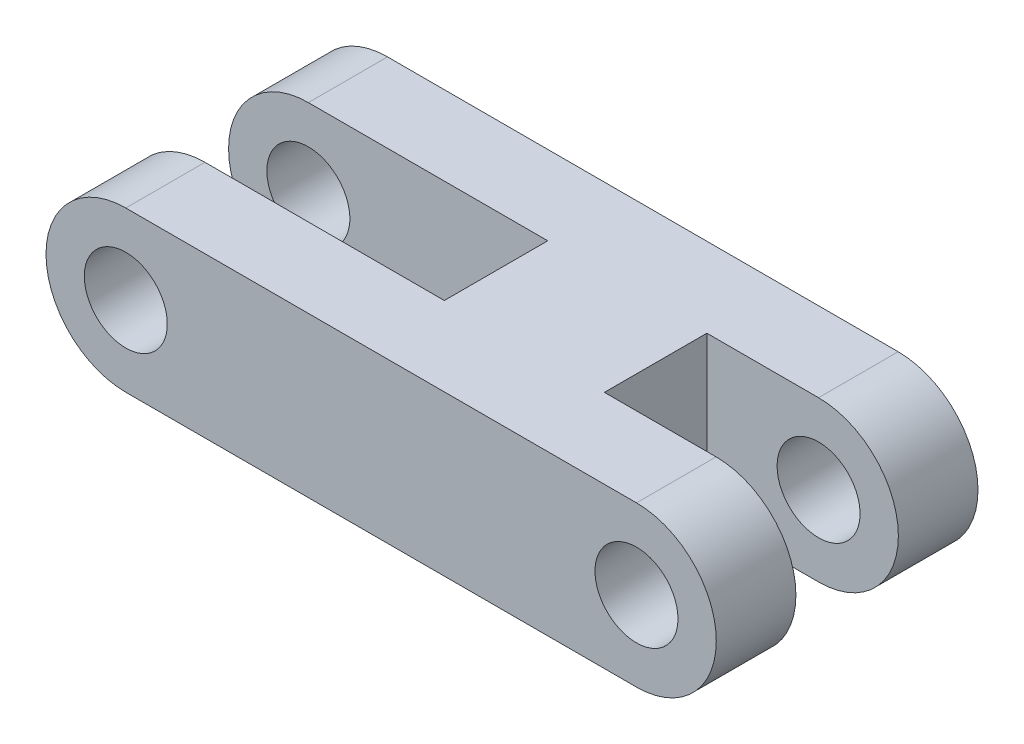
ISO-10303-21;
HEADER;
FILE_DESCRIPTION(('STEP AP214'),'2;1');
FILE_NAME('part.step','',(''),(''),'','','');
FILE_SCHEMA(('AUTOMOTIVE_DESIGN { 1 0 10303 214 1 1 1 1 }'));
ENDSEC;
DATA;
#1=APPLICATION_CONTEXT('core data for automotive mechanical design processes');
#2=APPLICATION_PROTOCOL_DEFINITION('international standard','automotive_design',2000,#1);
#3=PRODUCT_CONTEXT('',#1,'mechanical');
#4=PRODUCT('Part','Part','',(#3));
#5=PRODUCT_RELATED_PRODUCT_CATEGORY('part','',(#4));
#6=PRODUCT_DEFINITION_FORMATION('','',#4);
#7=PRODUCT_DEFINITION_CONTEXT('part definition',#1,'design');
#8=PRODUCT_DEFINITION('design','',#6,#7);
#9=PRODUCT_DEFINITION_SHAPE('','',#8);
#10=(LENGTH_UNIT() NAMED_UNIT(*) SI_UNIT(.MILLI.,.METRE.));
#11=(NAMED_UNIT(*) PLANE_ANGLE_UNIT() SI_UNIT($,.RADIAN.));
#12=(NAMED_UNIT(*) SI_UNIT($,.STERADIAN.) SOLID_ANGLE_UNIT());
#13=UNCERTAINTY_MEASURE_WITH_UNIT(LENGTH_MEASURE(1.E-05),#10,'distance_accuracy_value','');
#14=(GEOMETRIC_REPRESENTATION_CONTEXT(3) GLOBAL_UNCERTAINTY_ASSIGNED_CONTEXT((#13)) GLOBAL_UNIT_ASSIGNED_CONTEXT((#10,
#11,#12)) REPRESENTATION_CONTEXT('',''));
#15=CARTESIAN_POINT('',(0.,0.,0.));
#16=DIRECTION('',(0.,0.,1.));
#17=DIRECTION('',(1.,0.,0.));
#18=AXIS2_PLACEMENT_3D('',#15,#16,#17);
#19=CARTESIAN_POINT('',(-50.8588966961585,0.,10.414));
#20=DIRECTION('',(0.,0.,-1.));
#21=DIRECTION('',(-1.,0.,0.));
#22=AXIS2_PLACEMENT_3D('',#19,#20,#21);
#23=CYLINDRICAL_SURFACE('',#22,3.175);
#24=DIRECTION('',(0.,0.,-1.));
#25=VECTOR('',#24,1.);
#26=CARTESIAN_POINT('',(-50.8588966961585,3.17499999999999,10.414));
#27=LINE('',#26,#25);
#28=CARTESIAN_POINT('',(-50.8588966961585,3.17499999999999,3.16865));
#29=VERTEX_POINT('',#28);
#30=CARTESIAN_POINT('',(-50.8588966961585,3.17499999999999,0.));
#31=VERTEX_POINT('',#30);
#32=EDGE_CURVE('E222',#29,#31,#27,.T.);
#33=ORIENTED_EDGE('',*,*,#32,.F.);
#34=CARTESIAN_POINT('',(-50.8588966961585,0.,3.16865));
#35=DIRECTION('',(0.,0.,-1.));
#36=DIRECTION('',(-1.,0.,0.));
#37=AXIS2_PLACEMENT_3D('',#34,#35,#36);
#38=CIRCLE('',#37,3.175);
#39=CARTESIAN_POINT('',(-50.8588966961585,-3.17500000000001,3.16865));
#40=VERTEX_POINT('',#39);
#41=EDGE_CURVE('E155',#29,#40,#38,.T.);
#42=ORIENTED_EDGE('',*,*,#41,.T.);
#43=DIRECTION('',(0.,0.,-1.));
#44=VECTOR('',#43,1.);
#45=CARTESIAN_POINT('',(-50.8588966961586,-3.17500000000001,10.414));
#46=LINE('',#45,#44);
#47=CARTESIAN_POINT('',(-50.8588966961586,-3.17500000000001,0.));
#48=VERTEX_POINT('',#47);
#49=EDGE_CURVE('E226',#40,#48,#46,.T.);
#50=ORIENTED_EDGE('',*,*,#49,.T.);
#51=CARTESIAN_POINT('',(-50.8588966961585,0.,0.));
#52=DIRECTION('',(0.,0.,1.));
#53=DIRECTION('',(-1.,0.,0.));
#54=AXIS2_PLACEMENT_3D('',#51,#52,#53);
#55=CIRCLE('',#54,3.175);
#56=EDGE_CURVE('E214',#48,#31,#55,.T.);
#57=ORIENTED_EDGE('',*,*,#56,.T.);
#58=EDGE_LOOP('',(#33,#42,#50,#57));
#59=FACE_BOUND('',#58,.T.);
#60=ADVANCED_FACE('F32',(#59),#23,.T.);
#61=CARTESIAN_POINT('',(-50.8588966961585,0.,10.414));
#62=DIRECTION('',(0.,0.,-1.));
#63=DIRECTION('',(-1.,0.,0.));
#64=AXIS2_PLACEMENT_3D('',#61,#62,#63);
#65=CYLINDRICAL_SURFACE('',#64,1.651);
#66=CARTESIAN_POINT('',(-50.8588966961585,0.,3.16865));
#67=DIRECTION('',(0.,0.,-1.));
#68=DIRECTION('',(-1.,0.,0.));
#69=AXIS2_PLACEMENT_3D('',#66,#67,#68);
#70=CIRCLE('',#69,1.651);
#71=CARTESIAN_POINT('',(-52.5098966961585,0.,3.16865));
#72=VERTEX_POINT('',#71);
#73=EDGE_CURVE('E36',#72,#72,#70,.T.);
#74=ORIENTED_EDGE('',*,*,#73,.F.);
#75=EDGE_LOOP('',(#74));
#76=FACE_BOUND('',#75,.T.);
#77=CARTESIAN_POINT('',(-50.8588966961585,0.,0.));
#78=DIRECTION('',(0.,0.,1.));
#79=DIRECTION('',(1.,0.,0.));
#80=AXIS2_PLACEMENT_3D('',#77,#78,#79);
#81=CIRCLE('',#80,1.651);
#82=CARTESIAN_POINT('',(-49.2078966961585,0.,0.));
#83=VERTEX_POINT('',#82);
#84=EDGE_CURVE('E189',#83,#83,#81,.T.);
#85=ORIENTED_EDGE('',*,*,#84,.F.);
#86=EDGE_LOOP('',(#85));
#87=FACE_BOUND('',#86,.T.);
#88=ADVANCED_FACE('F242',(#76,#87),#65,.F.);
#89=CARTESIAN_POINT('',(-71.1788966961585,0.,10.414));
#90=DIRECTION('',(0.,0.,-1.));
#91=DIRECTION('',(-1.,0.,0.));
#92=AXIS2_PLACEMENT_3D('',#89,#90,#91);
#93=CYLINDRICAL_SURFACE('',#92,3.175);
#94=CARTESIAN_POINT('',(-71.1788966961585,0.,3.14960000000001));
#95=DIRECTION('',(0.,0.,-1.));
#96=DIRECTION('',(-1.,0.,0.));
#97=AXIS2_PLACEMENT_3D('',#94,#95,#96);
#98=CIRCLE('',#97,3.175);
#99=CARTESIAN_POINT('',(-71.1788966961585,-3.17500000000001,3.14960000000001));
#100=VERTEX_POINT('',#99);
#101=CARTESIAN_POINT('',(-71.1788966961585,3.17499999999999,3.14960000000001));
#102=VERTEX_POINT('',#101);
#103=EDGE_CURVE('E183',#100,#102,#98,.T.);
#104=ORIENTED_EDGE('',*,*,#103,.T.);
#105=DIRECTION('',(0.,0.,-1.));
#106=VECTOR('',#105,1.);
#107=CARTESIAN_POINT('',(-71.1788966961585,3.17499999999999,10.414));
#108=LINE('',#107,#106);
#109=CARTESIAN_POINT('',(-71.1788966961585,3.17499999999999,0.));
#110=VERTEX_POINT('',#109);
#111=EDGE_CURVE('E208',#102,#110,#108,.T.);
#112=ORIENTED_EDGE('',*,*,#111,.T.);
#113=CARTESIAN_POINT('',(-71.1788966961585,0.,0.));
#114=DIRECTION('',(0.,0.,1.));
#115=DIRECTION('',(1.,0.,0.));
#116=AXIS2_PLACEMENT_3D('',#113,#114,#115);
#117=CIRCLE('',#116,3.175);
#118=CARTESIAN_POINT('',(-71.1788966961585,-3.17500000000001,0.));
#119=VERTEX_POINT('',#118);
#120=EDGE_CURVE('E195',#110,#119,#117,.T.);
#121=ORIENTED_EDGE('',*,*,#120,.T.);
#122=DIRECTION('',(0.,0.,-1.));
#123=VECTOR('',#122,1.);
#124=CARTESIAN_POINT('',(-71.1788966961585,-3.17500000000001,10.414));
#125=LINE('',#124,#123);
#126=EDGE_CURVE('E41',#100,#119,#125,.T.);
#127=ORIENTED_EDGE('',*,*,#126,.F.);
#128=EDGE_LOOP('',(#104,#112,#121,#127));
#129=FACE_BOUND('',#128,.T.);
#130=ADVANCED_FACE('F269',(#129),#93,.T.);
#131=CARTESIAN_POINT('',(-71.1788966961585,0.,10.414));
#132=DIRECTION('',(0.,0.,-1.));
#133=DIRECTION('',(-1.,0.,0.));
#134=AXIS2_PLACEMENT_3D('',#131,#132,#133);
#135=CYLINDRICAL_SURFACE('',#134,1.65099999999999);
#136=CARTESIAN_POINT('',(-71.1788966961585,0.,3.14960000000001));
#137=DIRECTION('',(0.,0.,-1.));
#138=DIRECTION('',(-1.,0.,0.));
#139=AXIS2_PLACEMENT_3D('',#136,#137,#138);
#140=CIRCLE('',#139,1.65099999999999);
#141=CARTESIAN_POINT('',(-72.8298966961585,0.,3.14960000000001));
#142=VERTEX_POINT('',#141);
#143=EDGE_CURVE('E182',#142,#142,#140,.T.);
#144=ORIENTED_EDGE('',*,*,#143,.F.);
#145=EDGE_LOOP('',(#144));
#146=FACE_BOUND('',#145,.T.);
#147=CARTESIAN_POINT('',(-71.1788966961585,0.,0.));
#148=DIRECTION('',(0.,0.,1.));
#149=DIRECTION('',(-1.,0.,0.));
#150=AXIS2_PLACEMENT_3D('',#147,#148,#149);
#151=CIRCLE('',#150,1.65099999999999);
#152=CARTESIAN_POINT('',(-72.8298966961585,0.,0.));
#153=VERTEX_POINT('',#152);
#154=EDGE_CURVE('E185',#153,#153,#151,.T.);
#155=ORIENTED_EDGE('',*,*,#154,.F.);
#156=EDGE_LOOP('',(#155));
#157=FACE_BOUND('',#156,.T.);
#158=ADVANCED_FACE('F249',(#146,#157),#135,.F.);
#159=CARTESIAN_POINT('',(-71.1788966961585,0.,10.414));
#160=DIRECTION('',(0.,0.,1.));
#161=DIRECTION('',(1.,0.,0.));
#162=AXIS2_PLACEMENT_3D('',#159,#160,#161);
#163=PLANE('',#162);
#164=CARTESIAN_POINT('',(-50.8588966961585,0.,10.414));
#165=DIRECTION('',(0.,0.,1.));
#166=DIRECTION('',(1.,0.,0.));
#167=AXIS2_PLACEMENT_3D('',#164,#165,#166);
#168=CIRCLE('',#167,1.651);
#169=CARTESIAN_POINT('',(-49.2078966961585,0.,10.414));
#170=VERTEX_POINT('',#169);
#171=EDGE_CURVE('E192',#170,#170,#168,.T.);
#172=ORIENTED_EDGE('',*,*,#171,.F.);
#173=EDGE_LOOP('',(#172));
#174=FACE_BOUND('',#173,.T.);
#175=CARTESIAN_POINT('',(-71.1788966961585,0.,10.414));
#176=DIRECTION('',(0.,0.,1.));
#177=DIRECTION('',(1.,0.,0.));
#178=AXIS2_PLACEMENT_3D('',#175,#176,#177);
#179=CIRCLE('',#178,3.175);
#180=CARTESIAN_POINT('',(-71.1788966961585,3.17499999999999,10.414));
#181=VERTEX_POINT('',#180);
#182=CARTESIAN_POINT('',(-71.1788966961585,-3.17500000000001,10.414));
#183=VERTEX_POINT('',#182);
#184=EDGE_CURVE('E198',#181,#183,#179,.T.);
#185=ORIENTED_EDGE('',*,*,#184,.T.);
#186=DIRECTION('',(1.,0.,0.));
#187=VECTOR('',#186,1.);
#188=CARTESIAN_POINT('',(-71.1788966961585,-3.17500000000001,10.414));
#189=LINE('',#188,#187);
#190=CARTESIAN_POINT('',(-50.8588966961586,-3.17500000000001,10.414));
#191=VERTEX_POINT('',#190);
#192=EDGE_CURVE('E201',#183,#191,#189,.T.);
#193=ORIENTED_EDGE('',*,*,#192,.T.);
#194=CARTESIAN_POINT('',(-50.8588966961585,0.,10.414));
#195=DIRECTION('',(0.,0.,1.));
#196=DIRECTION('',(-1.,0.,0.));
#197=AXIS2_PLACEMENT_3D('',#194,#195,#196);
#198=CIRCLE('',#197,3.175);
#199=CARTESIAN_POINT('',(-50.8588966961585,3.17499999999999,10.414));
#200=VERTEX_POINT('',#199);
#201=EDGE_CURVE('E204',#191,#200,#198,.T.);
#202=ORIENTED_EDGE('',*,*,#201,.T.);
#203=DIRECTION('',(-1.,0.,0.));
#204=VECTOR('',#203,1.);
#205=CARTESIAN_POINT('',(-71.1788966961585,3.17499999999999,10.414));
#206=LINE('',#205,#204);
#207=EDGE_CURVE('E206',#200,#181,#206,.T.);
#208=ORIENTED_EDGE('',*,*,#207,.T.);
#209=EDGE_LOOP('',(#185,#193,#202,#208));
#210=FACE_BOUND('',#209,.T.);
#211=CARTESIAN_POINT('',(-71.1788966961585,0.,10.414));
#212=DIRECTION('',(0.,0.,1.));
#213=DIRECTION('',(-1.,0.,0.));
#214=AXIS2_PLACEMENT_3D('',#211,#212,#213);
#215=CIRCLE('',#214,1.65099999999999);
#216=CARTESIAN_POINT('',(-72.8298966961585,0.,10.414));
#217=VERTEX_POINT('',#216);
#218=EDGE_CURVE('E186',#217,#217,#215,.T.);
#219=ORIENTED_EDGE('',*,*,#218,.F.);
#220=EDGE_LOOP('',(#219));
#221=FACE_BOUND('',#220,.T.);
#222=ADVANCED_FACE('F245',(#174,#210,#221),#163,.T.);
#223=CARTESIAN_POINT('',(-71.1788966961585,0.,0.));
#224=DIRECTION('',(0.,0.,1.));
#225=DIRECTION('',(1.,0.,0.));
#226=AXIS2_PLACEMENT_3D('',#223,#224,#225);
#227=PLANE('',#226);
#228=ORIENTED_EDGE('',*,*,#84,.T.);
#229=EDGE_LOOP('',(#228));
#230=FACE_BOUND('',#229,.T.);
#231=ORIENTED_EDGE('',*,*,#120,.F.);
#232=DIRECTION('',(-1.,0.,0.));
#233=VECTOR('',#232,1.);
#234=CARTESIAN_POINT('',(-71.1788966961585,3.17499999999999,0.));
#235=LINE('',#234,#233);
#236=EDGE_CURVE('E202',#31,#110,#235,.T.);
#237=ORIENTED_EDGE('',*,*,#236,.F.);
#238=ORIENTED_EDGE('',*,*,#56,.F.);
#239=DIRECTION('',(1.,0.,0.));
#240=VECTOR('',#239,1.);
#241=CARTESIAN_POINT('',(-71.1788966961585,-3.17500000000001,0.));
#242=LINE('',#241,#240);
#243=EDGE_CURVE('E211',#119,#48,#242,.T.);
#244=ORIENTED_EDGE('',*,*,#243,.F.);
#245=EDGE_LOOP('',(#231,#237,#238,#244));
#246=FACE_BOUND('',#245,.T.);
#247=ORIENTED_EDGE('',*,*,#154,.T.);
#248=EDGE_LOOP('',(#247));
#249=FACE_BOUND('',#248,.T.);
#250=ADVANCED_FACE('F248',(#230,#246,#249),#227,.F.);
#251=CARTESIAN_POINT('',(-71.1788966961585,3.17499999999999,7.26440000000001));
#252=VERTEX_POINT('',#251);
#253=EDGE_CURVE('E219',#181,#252,#108,.T.);
#254=ORIENTED_EDGE('',*,*,#253,.T.);
#255=CARTESIAN_POINT('',(-71.1788966961585,0.,7.26440000000001));
#256=DIRECTION('',(0.,0.,1.));
#257=DIRECTION('',(1.,0.,0.));
#258=AXIS2_PLACEMENT_3D('',#255,#256,#257);
#259=CIRCLE('',#258,3.175);
#260=CARTESIAN_POINT('',(-71.1788966961585,-3.17500000000001,7.26440000000001));
#261=VERTEX_POINT('',#260);
#262=EDGE_CURVE('E57',#252,#261,#259,.T.);
#263=ORIENTED_EDGE('',*,*,#262,.T.);
#264=EDGE_CURVE('E11',#183,#261,#125,.T.);
#265=ORIENTED_EDGE('',*,*,#264,.F.);
#266=ORIENTED_EDGE('',*,*,#184,.F.);
#267=EDGE_LOOP('',(#254,#263,#265,#266));
#268=FACE_BOUND('',#267,.T.);
#269=ADVANCED_FACE('F34',(#268),#93,.T.);
#270=CARTESIAN_POINT('',(-71.1788966961585,-3.17500000000001,10.414));
#271=DIRECTION('',(0.,1.,0.));
#272=DIRECTION('',(-1.,0.,0.));
#273=AXIS2_PLACEMENT_3D('',#270,#271,#272);
#274=PLANE('',#273);
#275=ORIENTED_EDGE('',*,*,#49,.F.);
#276=DIRECTION('',(-1.,0.,0.));
#277=VECTOR('',#276,1.);
#278=CARTESIAN_POINT('',(-55.3038966961586,-3.17500000000001,3.16865));
#279=LINE('',#278,#277);
#280=CARTESIAN_POINT('',(-55.3038966961586,-3.17500000000001,3.16865));
#281=VERTEX_POINT('',#280);
#282=EDGE_CURVE('E131',#40,#281,#279,.T.);
#283=ORIENTED_EDGE('',*,*,#282,.T.);
#284=DIRECTION('',(0.,0.,1.));
#285=VECTOR('',#284,1.);
#286=CARTESIAN_POINT('',(-55.3038966961586,-3.17500000000001,7.24535));
#287=LINE('',#286,#285);
#288=CARTESIAN_POINT('',(-55.3038966961586,-3.17500000000001,7.24535));
#289=VERTEX_POINT('',#288);
#290=EDGE_CURVE('E126',#281,#289,#287,.T.);
#291=ORIENTED_EDGE('',*,*,#290,.T.);
#292=DIRECTION('',(1.,0.,0.));
#293=VECTOR('',#292,1.);
#294=CARTESIAN_POINT('',(-55.3038966961586,-3.17500000000001,7.24535));
#295=LINE('',#294,#293);
#296=CARTESIAN_POINT('',(-50.8588966961585,-3.17500000000001,7.24535));
#297=VERTEX_POINT('',#296);
#298=EDGE_CURVE('E134',#289,#297,#295,.T.);
#299=ORIENTED_EDGE('',*,*,#298,.T.);
#300=EDGE_CURVE('E227',#191,#297,#46,.T.);
#301=ORIENTED_EDGE('',*,*,#300,.F.);
#302=ORIENTED_EDGE('',*,*,#192,.F.);
#303=ORIENTED_EDGE('',*,*,#264,.T.);
#304=DIRECTION('',(1.,0.,0.));
#305=VECTOR('',#304,1.);
#306=CARTESIAN_POINT('',(-61.6538966961585,-3.17500000000001,7.26440000000001));
#307=LINE('',#306,#305);
#308=CARTESIAN_POINT('',(-61.6538966961585,-3.17500000000001,7.26440000000001));
#309=VERTEX_POINT('',#308);
#310=EDGE_CURVE('E159',#261,#309,#307,.T.);
#311=ORIENTED_EDGE('',*,*,#310,.T.);
#312=DIRECTION('',(0.,0.,-1.));
#313=VECTOR('',#312,1.);
#314=CARTESIAN_POINT('',(-61.6538966961585,-3.17500000000001,7.26440000000001));
#315=LINE('',#314,#313);
#316=CARTESIAN_POINT('',(-61.6538966961585,-3.17500000000001,3.1496));
#317=VERTEX_POINT('',#316);
#318=EDGE_CURVE('E162',#309,#317,#315,.T.);
#319=ORIENTED_EDGE('',*,*,#318,.T.);
#320=DIRECTION('',(-1.,0.,0.));
#321=VECTOR('',#320,1.);
#322=CARTESIAN_POINT('',(-61.6538966961585,-3.17500000000001,3.1496));
#323=LINE('',#322,#321);
#324=EDGE_CURVE('E166',#317,#100,#323,.T.);
#325=ORIENTED_EDGE('',*,*,#324,.T.);
#326=ORIENTED_EDGE('',*,*,#126,.T.);
#327=ORIENTED_EDGE('',*,*,#243,.T.);
#328=EDGE_LOOP('',(#275,#283,#291,#299,#301,#302,#303,#311,#319,#325,#326,#327));
#329=FACE_BOUND('',#328,.T.);
#330=ADVANCED_FACE('F143',(#329),#274,.F.);
#331=ORIENTED_EDGE('',*,*,#300,.T.);
#332=CARTESIAN_POINT('',(-50.8588966961585,0.,7.24535));
#333=DIRECTION('',(0.,0.,1.));
#334=DIRECTION('',(1.,0.,0.));
#335=AXIS2_PLACEMENT_3D('',#332,#333,#334);
#336=CIRCLE('',#335,3.175);
#337=CARTESIAN_POINT('',(-50.8588966961585,3.17499999999999,7.24535));
#338=VERTEX_POINT('',#337);
#339=EDGE_CURVE('E137',#297,#338,#336,.T.);
#340=ORIENTED_EDGE('',*,*,#339,.T.);
#341=EDGE_CURVE('E223',#200,#338,#27,.T.);
#342=ORIENTED_EDGE('',*,*,#341,.F.);
#343=ORIENTED_EDGE('',*,*,#201,.F.);
#344=EDGE_LOOP('',(#331,#340,#342,#343));
#345=FACE_BOUND('',#344,.T.);
#346=ADVANCED_FACE('F274',(#345),#23,.T.);
#347=CARTESIAN_POINT('',(-71.1788966961585,3.17499999999999,10.414));
#348=DIRECTION('',(0.,-1.,0.));
#349=DIRECTION('',(1.,0.,0.));
#350=AXIS2_PLACEMENT_3D('',#347,#348,#349);
#351=PLANE('',#350);
#352=DIRECTION('',(0.,0.,1.));
#353=VECTOR('',#352,1.);
#354=CARTESIAN_POINT('',(-55.3038966961586,3.17499999999999,7.24535));
#355=LINE('',#354,#353);
#356=CARTESIAN_POINT('',(-55.3038966961586,3.17499999999999,3.16865));
#357=VERTEX_POINT('',#356);
#358=CARTESIAN_POINT('',(-55.3038966961586,3.17499999999999,7.24535));
#359=VERTEX_POINT('',#358);
#360=EDGE_CURVE('E49',#357,#359,#355,.T.);
#361=ORIENTED_EDGE('',*,*,#360,.F.);
#362=DIRECTION('',(-1.,0.,0.));
#363=VECTOR('',#362,1.);
#364=CARTESIAN_POINT('',(-55.3038966961586,3.17499999999999,3.16865));
#365=LINE('',#364,#363);
#366=EDGE_CURVE('E144',#29,#357,#365,.T.);
#367=ORIENTED_EDGE('',*,*,#366,.F.);
#368=ORIENTED_EDGE('',*,*,#32,.T.);
#369=ORIENTED_EDGE('',*,*,#236,.T.);
#370=ORIENTED_EDGE('',*,*,#111,.F.);
#371=DIRECTION('',(-1.,0.,0.));
#372=VECTOR('',#371,1.);
#373=CARTESIAN_POINT('',(-61.6538966961585,3.17499999999999,3.1496));
#374=LINE('',#373,#372);
#375=CARTESIAN_POINT('',(-61.6538966961585,3.17499999999999,3.1496));
#376=VERTEX_POINT('',#375);
#377=EDGE_CURVE('E163',#376,#102,#374,.T.);
#378=ORIENTED_EDGE('',*,*,#377,.F.);
#379=DIRECTION('',(0.,0.,-1.));
#380=VECTOR('',#379,1.);
#381=CARTESIAN_POINT('',(-61.6538966961585,3.17499999999999,7.26440000000001));
#382=LINE('',#381,#380);
#383=CARTESIAN_POINT('',(-61.6538966961585,3.17499999999999,7.26440000000001));
#384=VERTEX_POINT('',#383);
#385=EDGE_CURVE('E171',#384,#376,#382,.T.);
#386=ORIENTED_EDGE('',*,*,#385,.F.);
#387=DIRECTION('',(1.,0.,0.));
#388=VECTOR('',#387,1.);
#389=CARTESIAN_POINT('',(-61.6538966961585,3.17499999999999,7.26440000000001));
#390=LINE('',#389,#388);
#391=EDGE_CURVE('E158',#252,#384,#390,.T.);
#392=ORIENTED_EDGE('',*,*,#391,.F.);
#393=ORIENTED_EDGE('',*,*,#253,.F.);
#394=ORIENTED_EDGE('',*,*,#207,.F.);
#395=ORIENTED_EDGE('',*,*,#341,.T.);
#396=DIRECTION('',(1.,0.,0.));
#397=VECTOR('',#396,1.);
#398=CARTESIAN_POINT('',(-55.3038966961586,3.17499999999999,7.24535));
#399=LINE('',#398,#397);
#400=EDGE_CURVE('E146',#359,#338,#399,.T.);
#401=ORIENTED_EDGE('',*,*,#400,.F.);
#402=EDGE_LOOP('',(#361,#367,#368,#369,#370,#378,#386,#392,#393,#394,#395,#401));
#403=FACE_BOUND('',#402,.T.);
#404=ADVANCED_FACE('F240',(#403),#351,.F.);
#405=CARTESIAN_POINT('',(-50.8588966961585,0.,7.24535));
#406=DIRECTION('',(0.,0.,1.));
#407=DIRECTION('',(1.,0.,0.));
#408=AXIS2_PLACEMENT_3D('',#405,#406,#407);
#409=CIRCLE('',#408,1.651);
#410=CARTESIAN_POINT('',(-49.2078966961585,0.,7.24535));
#411=VERTEX_POINT('',#410);
#412=EDGE_CURVE('E152',#411,#411,#409,.T.);
#413=ORIENTED_EDGE('',*,*,#412,.F.);
#414=EDGE_LOOP('',(#413));
#415=FACE_BOUND('',#414,.T.);
#416=ORIENTED_EDGE('',*,*,#171,.T.);
#417=EDGE_LOOP('',(#416));
#418=FACE_BOUND('',#417,.T.);
#419=ADVANCED_FACE('F236',(#415,#418),#65,.F.);
#420=CARTESIAN_POINT('',(-71.1788966961585,0.,7.26440000000001));
#421=DIRECTION('',(0.,0.,1.));
#422=DIRECTION('',(1.,0.,0.));
#423=AXIS2_PLACEMENT_3D('',#420,#421,#422);
#424=CIRCLE('',#423,1.65099999999999);
#425=CARTESIAN_POINT('',(-69.5278966961586,0.,7.26440000000001));
#426=VERTEX_POINT('',#425);
#427=EDGE_CURVE('E178',#426,#426,#424,.T.);
#428=ORIENTED_EDGE('',*,*,#427,.F.);
#429=EDGE_LOOP('',(#428));
#430=FACE_BOUND('',#429,.T.);
#431=ORIENTED_EDGE('',*,*,#218,.T.);
#432=EDGE_LOOP('',(#431));
#433=FACE_BOUND('',#432,.T.);
#434=ADVANCED_FACE('F239',(#430,#433),#135,.F.);
#435=CARTESIAN_POINT('',(-61.6538966961585,-3.17500000000001,3.1496));
#436=DIRECTION('',(0.,0.,-1.));
#437=DIRECTION('',(-1.,0.,0.));
#438=AXIS2_PLACEMENT_3D('',#435,#436,#437);
#439=PLANE('',#438);
#440=ORIENTED_EDGE('',*,*,#143,.T.);
#441=EDGE_LOOP('',(#440));
#442=FACE_BOUND('',#441,.T.);
#443=ORIENTED_EDGE('',*,*,#103,.F.);
#444=ORIENTED_EDGE('',*,*,#324,.F.);
#445=DIRECTION('',(0.,1.,0.));
#446=VECTOR('',#445,1.);
#447=CARTESIAN_POINT('',(-61.6538966961585,-3.17500000000001,3.1496));
#448=LINE('',#447,#446);
#449=EDGE_CURVE('E176',#317,#376,#448,.T.);
#450=ORIENTED_EDGE('',*,*,#449,.T.);
#451=ORIENTED_EDGE('',*,*,#377,.T.);
#452=EDGE_LOOP('',(#443,#444,#450,#451));
#453=FACE_BOUND('',#452,.T.);
#454=ADVANCED_FACE('F257',(#442,#453),#439,.F.);
#455=CARTESIAN_POINT('',(-61.6538966961585,-3.17500000000001,7.26440000000001));
#456=DIRECTION('',(0.,0.,1.));
#457=DIRECTION('',(1.,0.,0.));
#458=AXIS2_PLACEMENT_3D('',#455,#456,#457);
#459=PLANE('',#458);
#460=ORIENTED_EDGE('',*,*,#427,.T.);
#461=EDGE_LOOP('',(#460));
#462=FACE_BOUND('',#461,.T.);
#463=ORIENTED_EDGE('',*,*,#391,.T.);
#464=DIRECTION('',(0.,1.,0.));
#465=VECTOR('',#464,1.);
#466=CARTESIAN_POINT('',(-61.6538966961585,-3.17500000000001,7.26440000000001));
#467=LINE('',#466,#465);
#468=EDGE_CURVE('E169',#309,#384,#467,.T.);
#469=ORIENTED_EDGE('',*,*,#468,.F.);
#470=ORIENTED_EDGE('',*,*,#310,.F.);
#471=ORIENTED_EDGE('',*,*,#262,.F.);
#472=EDGE_LOOP('',(#463,#469,#470,#471));
#473=FACE_BOUND('',#472,.T.);
#474=ADVANCED_FACE('F263',(#462,#473),#459,.F.);
#475=CARTESIAN_POINT('',(-61.6538966961585,-3.17500000000001,7.26440000000001));
#476=DIRECTION('',(1.,0.,0.));
#477=DIRECTION('',(0.,1.,0.));
#478=AXIS2_PLACEMENT_3D('',#475,#476,#477);
#479=PLANE('',#478);
#480=ORIENTED_EDGE('',*,*,#385,.T.);
#481=ORIENTED_EDGE('',*,*,#449,.F.);
#482=ORIENTED_EDGE('',*,*,#318,.F.);
#483=ORIENTED_EDGE('',*,*,#468,.T.);
#484=EDGE_LOOP('',(#480,#481,#482,#483));
#485=FACE_BOUND('',#484,.T.);
#486=ADVANCED_FACE('F298',(#485),#479,.F.);
#487=CARTESIAN_POINT('',(-55.3038966961586,-3.17500000000001,3.16865));
#488=DIRECTION('',(0.,0.,-1.));
#489=DIRECTION('',(-1.,0.,0.));
#490=AXIS2_PLACEMENT_3D('',#487,#488,#489);
#491=PLANE('',#490);
#492=ORIENTED_EDGE('',*,*,#73,.T.);
#493=EDGE_LOOP('',(#492));
#494=FACE_BOUND('',#493,.T.);
#495=ORIENTED_EDGE('',*,*,#366,.T.);
#496=DIRECTION('',(0.,1.,0.));
#497=VECTOR('',#496,1.);
#498=CARTESIAN_POINT('',(-55.3038966961586,-3.17500000000001,3.16865));
#499=LINE('',#498,#497);
#500=EDGE_CURVE('E130',#281,#357,#499,.T.);
#501=ORIENTED_EDGE('',*,*,#500,.F.);
#502=ORIENTED_EDGE('',*,*,#282,.F.);
#503=ORIENTED_EDGE('',*,*,#41,.F.);
#504=EDGE_LOOP('',(#495,#501,#502,#503));
#505=FACE_BOUND('',#504,.T.);
#506=ADVANCED_FACE('F311',(#494,#505),#491,.F.);
#507=CARTESIAN_POINT('',(-55.3038966961586,-3.17500000000001,7.24535));
#508=DIRECTION('',(0.,0.,1.));
#509=DIRECTION('',(1.,0.,0.));
#510=AXIS2_PLACEMENT_3D('',#507,#508,#509);
#511=PLANE('',#510);
#512=ORIENTED_EDGE('',*,*,#412,.T.);
#513=EDGE_LOOP('',(#512));
#514=FACE_BOUND('',#513,.T.);
#515=ORIENTED_EDGE('',*,*,#298,.F.);
#516=DIRECTION('',(0.,1.,0.));
#517=VECTOR('',#516,1.);
#518=CARTESIAN_POINT('',(-55.3038966961586,-3.17500000000001,7.24535));
#519=LINE('',#518,#517);
#520=EDGE_CURVE('E122',#289,#359,#519,.T.);
#521=ORIENTED_EDGE('',*,*,#520,.T.);
#522=ORIENTED_EDGE('',*,*,#400,.T.);
#523=ORIENTED_EDGE('',*,*,#339,.F.);
#524=EDGE_LOOP('',(#515,#521,#522,#523));
#525=FACE_BOUND('',#524,.T.);
#526=ADVANCED_FACE('F135',(#514,#525),#511,.F.);
#527=CARTESIAN_POINT('',(-55.3038966961586,-3.17500000000001,7.24535));
#528=DIRECTION('',(-1.,0.,0.));
#529=DIRECTION('',(0.,-1.,0.));
#530=AXIS2_PLACEMENT_3D('',#527,#528,#529);
#531=PLANE('',#530);
#532=ORIENTED_EDGE('',*,*,#360,.T.);
#533=ORIENTED_EDGE('',*,*,#520,.F.);
#534=ORIENTED_EDGE('',*,*,#290,.F.);
#535=ORIENTED_EDGE('',*,*,#500,.T.);
#536=EDGE_LOOP('',(#532,#533,#534,#535));
#537=FACE_BOUND('',#536,.T.);
#538=ADVANCED_FACE('F124',(#537),#531,.F.);
#539=CLOSED_SHELL('',(#60,#88,#130,#158,#222,#250,#269,#330,#346,#404,#419,#434,#454,#474,#486,
#506,#526,#538));
#540=MANIFOLD_SOLID_BREP('B2',#539);
#541=ADVANCED_BREP_SHAPE_REPRESENTATION('',(#18,#540),#14);
#542=SHAPE_DEFINITION_REPRESENTATION(#9,#541);
ENDSEC;
END-ISO-10303-21;
